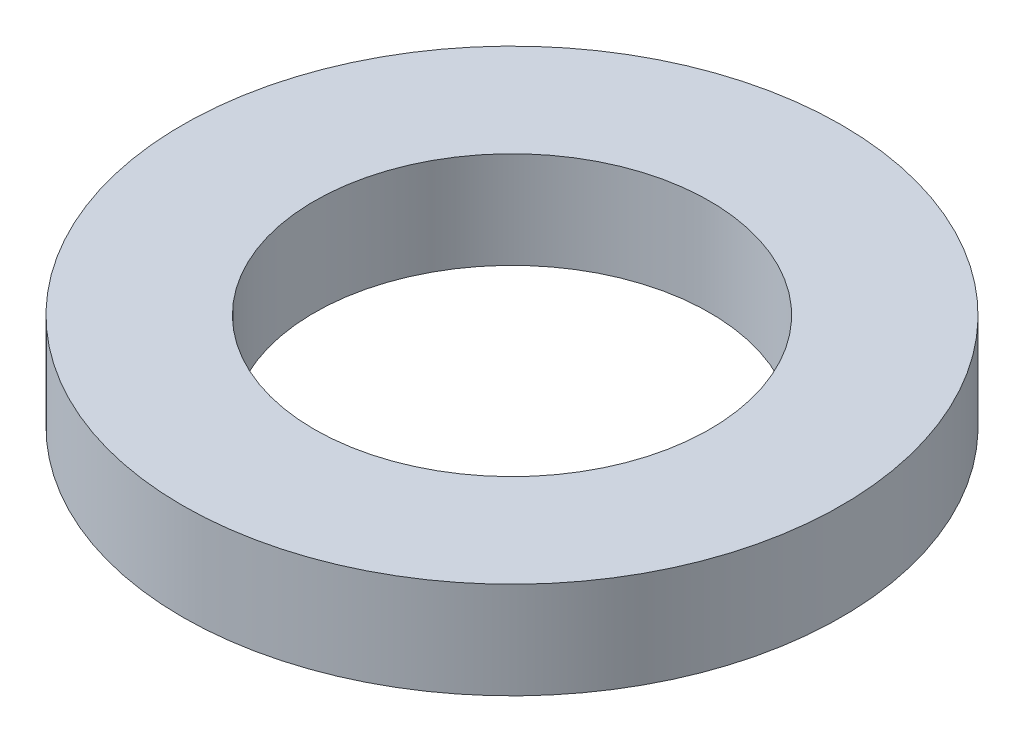
ISO-10303-21;
HEADER;
FILE_DESCRIPTION(('STEP AP214'),'2;1');
FILE_NAME('part.step','',(''),(''),'','','');
FILE_SCHEMA(('AUTOMOTIVE_DESIGN { 1 0 10303 214 1 1 1 1 }'));
ENDSEC;
DATA;
#1=APPLICATION_CONTEXT('core data for automotive mechanical design processes');
#2=APPLICATION_PROTOCOL_DEFINITION('international standard','automotive_design',2000,#1);
#3=PRODUCT_CONTEXT('',#1,'mechanical');
#4=PRODUCT('Part','Part','',(#3));
#5=PRODUCT_RELATED_PRODUCT_CATEGORY('part','',(#4));
#6=PRODUCT_DEFINITION_FORMATION('','',#4);
#7=PRODUCT_DEFINITION_CONTEXT('part definition',#1,'design');
#8=PRODUCT_DEFINITION('design','',#6,#7);
#9=PRODUCT_DEFINITION_SHAPE('','',#8);
#10=(LENGTH_UNIT() NAMED_UNIT(*) SI_UNIT(.MILLI.,.METRE.));
#11=(NAMED_UNIT(*) PLANE_ANGLE_UNIT() SI_UNIT($,.RADIAN.));
#12=(NAMED_UNIT(*) SI_UNIT($,.STERADIAN.) SOLID_ANGLE_UNIT());
#13=UNCERTAINTY_MEASURE_WITH_UNIT(LENGTH_MEASURE(1.E-05),#10,'distance_accuracy_value','');
#14=(GEOMETRIC_REPRESENTATION_CONTEXT(3) GLOBAL_UNCERTAINTY_ASSIGNED_CONTEXT((#13)) GLOBAL_UNIT_ASSIGNED_CONTEXT((#10,
#11,#12)) REPRESENTATION_CONTEXT('',''));
#15=CARTESIAN_POINT('',(0.,0.,0.));
#16=DIRECTION('',(0.,0.,1.));
#17=DIRECTION('',(1.,0.,0.));
#18=AXIS2_PLACEMENT_3D('',#15,#16,#17);
#19=CARTESIAN_POINT('',(0.,22.,0.));
#20=DIRECTION('',(0.,-1.,0.));
#21=DIRECTION('',(0.,0.,-1.));
#22=AXIS2_PLACEMENT_3D('',#19,#20,#21);
#23=CYLINDRICAL_SURFACE('',#22,75.);
#24=CARTESIAN_POINT('',(0.,22.,0.));
#25=DIRECTION('',(0.,1.,0.));
#26=DIRECTION('',(0.,0.,1.));
#27=AXIS2_PLACEMENT_3D('',#24,#25,#26);
#28=CIRCLE('',#27,75.);
#29=CARTESIAN_POINT('',(0.,22.,75.));
#30=VERTEX_POINT('',#29);
#31=EDGE_CURVE('E10',#30,#30,#28,.T.);
#32=ORIENTED_EDGE('',*,*,#31,.F.);
#33=EDGE_LOOP('',(#32));
#34=FACE_BOUND('',#33,.T.);
#35=CARTESIAN_POINT('',(0.,0.,0.));
#36=DIRECTION('',(0.,1.,0.));
#37=DIRECTION('',(0.,0.,1.));
#38=AXIS2_PLACEMENT_3D('',#35,#36,#37);
#39=CIRCLE('',#38,75.);
#40=CARTESIAN_POINT('',(0.,0.,75.));
#41=VERTEX_POINT('',#40);
#42=EDGE_CURVE('E37',#41,#41,#39,.T.);
#43=ORIENTED_EDGE('',*,*,#42,.T.);
#44=EDGE_LOOP('',(#43));
#45=FACE_BOUND('',#44,.T.);
#46=ADVANCED_FACE('F40',(#34,#45),#23,.T.);
#47=CARTESIAN_POINT('',(0.,22.,0.));
#48=DIRECTION('',(0.,1.,0.));
#49=DIRECTION('',(0.,0.,1.));
#50=AXIS2_PLACEMENT_3D('',#47,#48,#49);
#51=PLANE('',#50);
#52=CARTESIAN_POINT('',(0.,22.,0.));
#53=DIRECTION('',(0.,1.,0.));
#54=DIRECTION('',(0.,0.,1.));
#55=AXIS2_PLACEMENT_3D('',#52,#53,#54);
#56=CIRCLE('',#55,45.);
#57=CARTESIAN_POINT('',(0.,22.,45.));
#58=VERTEX_POINT('',#57);
#59=EDGE_CURVE('E50',#58,#58,#56,.T.);
#60=ORIENTED_EDGE('',*,*,#59,.F.);
#61=EDGE_LOOP('',(#60));
#62=FACE_BOUND('',#61,.T.);
#63=ORIENTED_EDGE('',*,*,#31,.T.);
#64=EDGE_LOOP('',(#63));
#65=FACE_BOUND('',#64,.T.);
#66=ADVANCED_FACE('F59',(#62,#65),#51,.T.);
#67=CARTESIAN_POINT('',(0.,0.,0.));
#68=DIRECTION('',(0.,1.,0.));
#69=DIRECTION('',(0.,0.,1.));
#70=AXIS2_PLACEMENT_3D('',#67,#68,#69);
#71=PLANE('',#70);
#72=CARTESIAN_POINT('',(0.,0.,0.));
#73=DIRECTION('',(0.,1.,0.));
#74=DIRECTION('',(0.,0.,1.));
#75=AXIS2_PLACEMENT_3D('',#72,#73,#74);
#76=CIRCLE('',#75,45.);
#77=CARTESIAN_POINT('',(0.,0.,45.));
#78=VERTEX_POINT('',#77);
#79=EDGE_CURVE('E47',#78,#78,#76,.T.);
#80=ORIENTED_EDGE('',*,*,#79,.T.);
#81=EDGE_LOOP('',(#80));
#82=FACE_BOUND('',#81,.T.);
#83=ORIENTED_EDGE('',*,*,#42,.F.);
#84=EDGE_LOOP('',(#83));
#85=FACE_BOUND('',#84,.T.);
#86=ADVANCED_FACE('F58',(#82,#85),#71,.F.);
#87=CARTESIAN_POINT('',(0.,22.,0.));
#88=DIRECTION('',(0.,-1.,0.));
#89=DIRECTION('',(0.,0.,-1.));
#90=AXIS2_PLACEMENT_3D('',#87,#88,#89);
#91=CYLINDRICAL_SURFACE('',#90,45.);
#92=ORIENTED_EDGE('',*,*,#59,.T.);
#93=EDGE_LOOP('',(#92));
#94=FACE_BOUND('',#93,.T.);
#95=ORIENTED_EDGE('',*,*,#79,.F.);
#96=EDGE_LOOP('',(#95));
#97=FACE_BOUND('',#96,.T.);
#98=ADVANCED_FACE('F54',(#94,#97),#91,.F.);
#99=CLOSED_SHELL('',(#46,#66,#86,#98));
#100=MANIFOLD_SOLID_BREP('B2',#99);
#101=ADVANCED_BREP_SHAPE_REPRESENTATION('',(#18,#100),#14);
#102=SHAPE_DEFINITION_REPRESENTATION(#9,#101);
ENDSEC;
END-ISO-10303-21;
